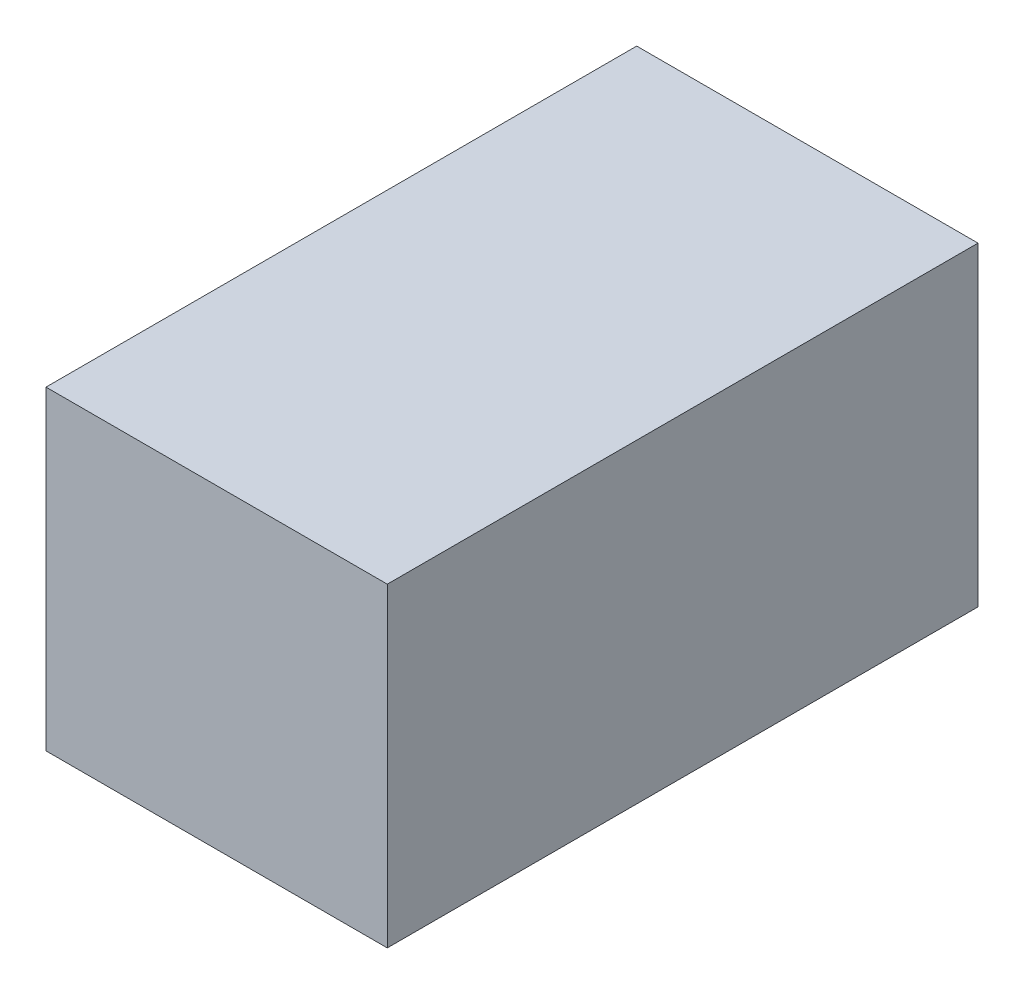
ISO-10303-21;
HEADER;
FILE_DESCRIPTION(('STEP AP214'),'2;1');
FILE_NAME('part.step','',(''),(''),'','','');
FILE_SCHEMA(('AUTOMOTIVE_DESIGN { 1 0 10303 214 1 1 1 1 }'));
ENDSEC;
DATA;
#1=APPLICATION_CONTEXT('core data for automotive mechanical design processes');
#2=APPLICATION_PROTOCOL_DEFINITION('international standard','automotive_design',2000,#1);
#3=PRODUCT_CONTEXT('',#1,'mechanical');
#4=PRODUCT('Part','Part','',(#3));
#5=PRODUCT_RELATED_PRODUCT_CATEGORY('part','',(#4));
#6=PRODUCT_DEFINITION_FORMATION('','',#4);
#7=PRODUCT_DEFINITION_CONTEXT('part definition',#1,'design');
#8=PRODUCT_DEFINITION('design','',#6,#7);
#9=PRODUCT_DEFINITION_SHAPE('','',#8);
#10=(LENGTH_UNIT() NAMED_UNIT(*) SI_UNIT(.MILLI.,.METRE.));
#11=(NAMED_UNIT(*) PLANE_ANGLE_UNIT() SI_UNIT($,.RADIAN.));
#12=(NAMED_UNIT(*) SI_UNIT($,.STERADIAN.) SOLID_ANGLE_UNIT());
#13=UNCERTAINTY_MEASURE_WITH_UNIT(LENGTH_MEASURE(1.E-05),#10,'distance_accuracy_value','');
#14=(GEOMETRIC_REPRESENTATION_CONTEXT(3) GLOBAL_UNCERTAINTY_ASSIGNED_CONTEXT((#13)) GLOBAL_UNIT_ASSIGNED_CONTEXT((#10,
#11,#12)) REPRESENTATION_CONTEXT('',''));
#15=CARTESIAN_POINT('',(0.,0.,0.));
#16=DIRECTION('',(0.,0.,1.));
#17=DIRECTION('',(1.,0.,0.));
#18=AXIS2_PLACEMENT_3D('',#15,#16,#17);
#19=CARTESIAN_POINT('',(13.,12.,-22.5));
#20=DIRECTION('',(-1.,0.,0.));
#21=DIRECTION('',(0.,0.,1.));
#22=AXIS2_PLACEMENT_3D('',#19,#20,#21);
#23=PLANE('',#22);
#24=DIRECTION('',(0.,0.,-1.));
#25=VECTOR('',#24,1.);
#26=CARTESIAN_POINT('',(13.,-12.,-22.5));
#27=LINE('',#26,#25);
#28=CARTESIAN_POINT('',(13.,-12.,22.5));
#29=VERTEX_POINT('',#28);
#30=CARTESIAN_POINT('',(13.,-12.,-22.5));
#31=VERTEX_POINT('',#30);
#32=EDGE_CURVE('E104',#29,#31,#27,.T.);
#33=ORIENTED_EDGE('',*,*,#32,.T.);
#34=DIRECTION('',(0.,-1.,0.));
#35=VECTOR('',#34,1.);
#36=CARTESIAN_POINT('',(13.,12.,-22.5));
#37=LINE('',#36,#35);
#38=CARTESIAN_POINT('',(13.,12.,-22.5));
#39=VERTEX_POINT('',#38);
#40=EDGE_CURVE('E11',#39,#31,#37,.T.);
#41=ORIENTED_EDGE('',*,*,#40,.F.);
#42=DIRECTION('',(0.,0.,-1.));
#43=VECTOR('',#42,1.);
#44=CARTESIAN_POINT('',(13.,12.,-22.5));
#45=LINE('',#44,#43);
#46=CARTESIAN_POINT('',(13.,12.,22.5));
#47=VERTEX_POINT('',#46);
#48=EDGE_CURVE('E92',#47,#39,#45,.T.);
#49=ORIENTED_EDGE('',*,*,#48,.F.);
#50=DIRECTION('',(0.,-1.,0.));
#51=VECTOR('',#50,1.);
#52=CARTESIAN_POINT('',(13.,12.,22.5));
#53=LINE('',#52,#51);
#54=EDGE_CURVE('E100',#47,#29,#53,.T.);
#55=ORIENTED_EDGE('',*,*,#54,.T.);
#56=EDGE_LOOP('',(#33,#41,#49,#55));
#57=FACE_BOUND('',#56,.T.);
#58=ADVANCED_FACE('F41',(#57),#23,.F.);
#59=CARTESIAN_POINT('',(-13.,12.,-22.5));
#60=DIRECTION('',(0.,0.,1.));
#61=DIRECTION('',(1.,0.,0.));
#62=AXIS2_PLACEMENT_3D('',#59,#60,#61);
#63=PLANE('',#62);
#64=DIRECTION('',(-1.,0.,0.));
#65=VECTOR('',#64,1.);
#66=CARTESIAN_POINT('',(-13.,-12.,-22.5));
#67=LINE('',#66,#65);
#68=CARTESIAN_POINT('',(-13.,-12.,-22.5));
#69=VERTEX_POINT('',#68);
#70=EDGE_CURVE('E96',#31,#69,#67,.T.);
#71=ORIENTED_EDGE('',*,*,#70,.T.);
#72=DIRECTION('',(0.,-1.,0.));
#73=VECTOR('',#72,1.);
#74=CARTESIAN_POINT('',(-13.,12.,-22.5));
#75=LINE('',#74,#73);
#76=CARTESIAN_POINT('',(-13.,12.,-22.5));
#77=VERTEX_POINT('',#76);
#78=EDGE_CURVE('E49',#77,#69,#75,.T.);
#79=ORIENTED_EDGE('',*,*,#78,.F.);
#80=DIRECTION('',(-1.,0.,0.));
#81=VECTOR('',#80,1.);
#82=CARTESIAN_POINT('',(-13.,12.,-22.5));
#83=LINE('',#82,#81);
#84=EDGE_CURVE('E87',#39,#77,#83,.T.);
#85=ORIENTED_EDGE('',*,*,#84,.F.);
#86=ORIENTED_EDGE('',*,*,#40,.T.);
#87=EDGE_LOOP('',(#71,#79,#85,#86));
#88=FACE_BOUND('',#87,.T.);
#89=ADVANCED_FACE('F95',(#88),#63,.F.);
#90=CARTESIAN_POINT('',(-13.,12.,-22.5));
#91=DIRECTION('',(1.,0.,0.));
#92=DIRECTION('',(0.,0.,-1.));
#93=AXIS2_PLACEMENT_3D('',#90,#91,#92);
#94=PLANE('',#93);
#95=DIRECTION('',(0.,0.,1.));
#96=VECTOR('',#95,1.);
#97=CARTESIAN_POINT('',(-13.,-12.,-22.5));
#98=LINE('',#97,#96);
#99=CARTESIAN_POINT('',(-13.,-12.,22.5));
#100=VERTEX_POINT('',#99);
#101=EDGE_CURVE('E74',#69,#100,#98,.T.);
#102=ORIENTED_EDGE('',*,*,#101,.T.);
#103=DIRECTION('',(0.,-1.,0.));
#104=VECTOR('',#103,1.);
#105=CARTESIAN_POINT('',(-13.,12.,22.5));
#106=LINE('',#105,#104);
#107=CARTESIAN_POINT('',(-13.,12.,22.5));
#108=VERTEX_POINT('',#107);
#109=EDGE_CURVE('E97',#108,#100,#106,.T.);
#110=ORIENTED_EDGE('',*,*,#109,.F.);
#111=DIRECTION('',(0.,0.,1.));
#112=VECTOR('',#111,1.);
#113=CARTESIAN_POINT('',(-13.,12.,-22.5));
#114=LINE('',#113,#112);
#115=EDGE_CURVE('E90',#77,#108,#114,.T.);
#116=ORIENTED_EDGE('',*,*,#115,.F.);
#117=ORIENTED_EDGE('',*,*,#78,.T.);
#118=EDGE_LOOP('',(#102,#110,#116,#117));
#119=FACE_BOUND('',#118,.T.);
#120=ADVANCED_FACE('F98',(#119),#94,.F.);
#121=CARTESIAN_POINT('',(-13.,12.,22.5));
#122=DIRECTION('',(0.,0.,-1.));
#123=DIRECTION('',(-1.,0.,0.));
#124=AXIS2_PLACEMENT_3D('',#121,#122,#123);
#125=PLANE('',#124);
#126=DIRECTION('',(1.,0.,0.));
#127=VECTOR('',#126,1.);
#128=CARTESIAN_POINT('',(-13.,-12.,22.5));
#129=LINE('',#128,#127);
#130=EDGE_CURVE('E80',#100,#29,#129,.T.);
#131=ORIENTED_EDGE('',*,*,#130,.T.);
#132=ORIENTED_EDGE('',*,*,#54,.F.);
#133=DIRECTION('',(1.,0.,0.));
#134=VECTOR('',#133,1.);
#135=CARTESIAN_POINT('',(-13.,12.,22.5));
#136=LINE('',#135,#134);
#137=EDGE_CURVE('E57',#108,#47,#136,.T.);
#138=ORIENTED_EDGE('',*,*,#137,.F.);
#139=ORIENTED_EDGE('',*,*,#109,.T.);
#140=EDGE_LOOP('',(#131,#132,#138,#139));
#141=FACE_BOUND('',#140,.T.);
#142=ADVANCED_FACE('F111',(#141),#125,.F.);
#143=CARTESIAN_POINT('',(0.,12.,0.));
#144=DIRECTION('',(0.,1.,0.));
#145=DIRECTION('',(0.,0.,1.));
#146=AXIS2_PLACEMENT_3D('',#143,#144,#145);
#147=PLANE('',#146);
#148=ORIENTED_EDGE('',*,*,#48,.T.);
#149=ORIENTED_EDGE('',*,*,#84,.T.);
#150=ORIENTED_EDGE('',*,*,#115,.T.);
#151=ORIENTED_EDGE('',*,*,#137,.T.);
#152=EDGE_LOOP('',(#148,#149,#150,#151));
#153=FACE_BOUND('',#152,.T.);
#154=ADVANCED_FACE('F88',(#153),#147,.T.);
#155=CARTESIAN_POINT('',(0.,-12.,0.));
#156=DIRECTION('',(0.,1.,0.));
#157=DIRECTION('',(0.,0.,1.));
#158=AXIS2_PLACEMENT_3D('',#155,#156,#157);
#159=PLANE('',#158);
#160=ORIENTED_EDGE('',*,*,#32,.F.);
#161=ORIENTED_EDGE('',*,*,#130,.F.);
#162=ORIENTED_EDGE('',*,*,#101,.F.);
#163=ORIENTED_EDGE('',*,*,#70,.F.);
#164=EDGE_LOOP('',(#160,#161,#162,#163));
#165=FACE_BOUND('',#164,.T.);
#166=ADVANCED_FACE('F114',(#165),#159,.F.);
#167=CLOSED_SHELL('',(#58,#89,#120,#142,#154,#166));
#168=MANIFOLD_SOLID_BREP('B2',#167);
#169=ADVANCED_BREP_SHAPE_REPRESENTATION('',(#18,#168),#14);
#170=SHAPE_DEFINITION_REPRESENTATION(#9,#169);
ENDSEC;
END-ISO-10303-21;
